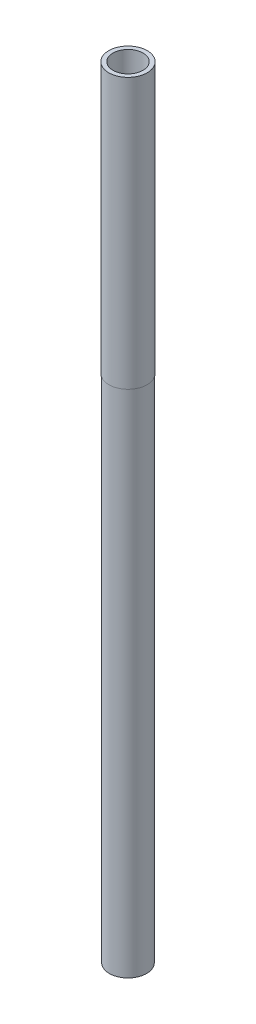
ISO-10303-21;
HEADER;
FILE_DESCRIPTION(('STEP AP214'),'2;1');
FILE_NAME('part.step','',(''),(''),'','','');
FILE_SCHEMA(('AUTOMOTIVE_DESIGN { 1 0 10303 214 1 1 1 1 }'));
ENDSEC;
DATA;
#1=APPLICATION_CONTEXT('core data for automotive mechanical design processes');
#2=APPLICATION_PROTOCOL_DEFINITION('international standard','automotive_design',2000,#1);
#3=PRODUCT_CONTEXT('',#1,'mechanical');
#4=PRODUCT('Part','Part','',(#3));
#5=PRODUCT_RELATED_PRODUCT_CATEGORY('part','',(#4));
#6=PRODUCT_DEFINITION_FORMATION('','',#4);
#7=PRODUCT_DEFINITION_CONTEXT('part definition',#1,'design');
#8=PRODUCT_DEFINITION('design','',#6,#7);
#9=PRODUCT_DEFINITION_SHAPE('','',#8);
#10=(LENGTH_UNIT() NAMED_UNIT(*) SI_UNIT(.MILLI.,.METRE.));
#11=(NAMED_UNIT(*) PLANE_ANGLE_UNIT() SI_UNIT($,.RADIAN.));
#12=(NAMED_UNIT(*) SI_UNIT($,.STERADIAN.) SOLID_ANGLE_UNIT());
#13=UNCERTAINTY_MEASURE_WITH_UNIT(LENGTH_MEASURE(1.E-05),#10,'distance_accuracy_value','');
#14=(GEOMETRIC_REPRESENTATION_CONTEXT(3) GLOBAL_UNCERTAINTY_ASSIGNED_CONTEXT((#13)) GLOBAL_UNIT_ASSIGNED_CONTEXT((#10,
#11,#12)) REPRESENTATION_CONTEXT('',''));
#15=CARTESIAN_POINT('',(0.,0.,0.));
#16=DIRECTION('',(0.,0.,1.));
#17=DIRECTION('',(1.,0.,0.));
#18=AXIS2_PLACEMENT_3D('',#15,#16,#17);
#19=CARTESIAN_POINT('',(0.,13.,0.));
#20=DIRECTION('',(0.,-1.,0.));
#21=DIRECTION('',(0.,0.,-1.));
#22=AXIS2_PLACEMENT_3D('',#19,#20,#21);
#23=CYLINDRICAL_SURFACE('',#22,0.310000000000001);
#24=CARTESIAN_POINT('',(0.,0.,0.));
#25=DIRECTION('',(0.,1.,0.));
#26=DIRECTION('',(0.,0.,1.));
#27=AXIS2_PLACEMENT_3D('',#24,#25,#26);
#28=CIRCLE('',#27,0.310000000000001);
#29=CARTESIAN_POINT('',(0.,0.,0.310000000000001));
#30=VERTEX_POINT('',#29);
#31=EDGE_CURVE('E36',#30,#30,#28,.T.);
#32=ORIENTED_EDGE('',*,*,#31,.T.);
#33=EDGE_LOOP('',(#32));
#34=FACE_BOUND('',#33,.T.);
#35=CARTESIAN_POINT('',(0.,8.5,0.));
#36=DIRECTION('',(0.,1.,0.));
#37=DIRECTION('',(0.,0.,1.));
#38=AXIS2_PLACEMENT_3D('',#35,#36,#37);
#39=CIRCLE('',#38,0.310000000000001);
#40=CARTESIAN_POINT('',(0.,8.5,0.310000000000001));
#41=VERTEX_POINT('',#40);
#42=EDGE_CURVE('E10',#41,#41,#39,.T.);
#43=ORIENTED_EDGE('',*,*,#42,.F.);
#44=EDGE_LOOP('',(#43));
#45=FACE_BOUND('',#44,.T.);
#46=ADVANCED_FACE('F30',(#34,#45),#23,.T.);
#47=CARTESIAN_POINT('',(0.,13.,0.));
#48=DIRECTION('',(0.,1.,0.));
#49=DIRECTION('',(0.,0.,1.));
#50=AXIS2_PLACEMENT_3D('',#47,#48,#49);
#51=PLANE('',#50);
#52=CARTESIAN_POINT('',(0.,13.,0.));
#53=DIRECTION('',(0.,1.,0.));
#54=DIRECTION('',(0.,0.,1.));
#55=AXIS2_PLACEMENT_3D('',#52,#53,#54);
#56=CIRCLE('',#55,0.25);
#57=CARTESIAN_POINT('',(0.,13.,0.25));
#58=VERTEX_POINT('',#57);
#59=EDGE_CURVE('E40',#58,#58,#56,.T.);
#60=ORIENTED_EDGE('',*,*,#59,.F.);
#61=EDGE_LOOP('',(#60));
#62=FACE_BOUND('',#61,.T.);
#63=CARTESIAN_POINT('',(0.,13.,0.));
#64=DIRECTION('',(0.,1.,0.));
#65=DIRECTION('',(0.,0.,1.));
#66=AXIS2_PLACEMENT_3D('',#63,#64,#65);
#67=CIRCLE('',#66,0.320000000000001);
#68=CARTESIAN_POINT('',(0.,13.,0.320000000000001));
#69=VERTEX_POINT('',#68);
#70=EDGE_CURVE('E50',#69,#69,#67,.T.);
#71=ORIENTED_EDGE('',*,*,#70,.T.);
#72=EDGE_LOOP('',(#71));
#73=FACE_BOUND('',#72,.T.);
#74=ADVANCED_FACE('F68',(#62,#73),#51,.T.);
#75=CARTESIAN_POINT('',(0.,0.,0.));
#76=DIRECTION('',(0.,1.,0.));
#77=DIRECTION('',(0.,0.,1.));
#78=AXIS2_PLACEMENT_3D('',#75,#76,#77);
#79=PLANE('',#78);
#80=ORIENTED_EDGE('',*,*,#31,.F.);
#81=EDGE_LOOP('',(#80));
#82=FACE_BOUND('',#81,.T.);
#83=CARTESIAN_POINT('',(0.,0.,0.));
#84=DIRECTION('',(0.,1.,0.));
#85=DIRECTION('',(0.,0.,1.));
#86=AXIS2_PLACEMENT_3D('',#83,#84,#85);
#87=CIRCLE('',#86,0.25);
#88=CARTESIAN_POINT('',(0.,0.,0.25));
#89=VERTEX_POINT('',#88);
#90=EDGE_CURVE('E44',#89,#89,#87,.T.);
#91=ORIENTED_EDGE('',*,*,#90,.T.);
#92=EDGE_LOOP('',(#91));
#93=FACE_BOUND('',#92,.T.);
#94=ADVANCED_FACE('F72',(#82,#93),#79,.F.);
#95=CARTESIAN_POINT('',(0.,13.,0.));
#96=DIRECTION('',(0.,-1.,0.));
#97=DIRECTION('',(0.,0.,-1.));
#98=AXIS2_PLACEMENT_3D('',#95,#96,#97);
#99=CYLINDRICAL_SURFACE('',#98,0.25);
#100=ORIENTED_EDGE('',*,*,#59,.T.);
#101=EDGE_LOOP('',(#100));
#102=FACE_BOUND('',#101,.T.);
#103=ORIENTED_EDGE('',*,*,#90,.F.);
#104=EDGE_LOOP('',(#103));
#105=FACE_BOUND('',#104,.T.);
#106=ADVANCED_FACE('F65',(#102,#105),#99,.F.);
#107=CARTESIAN_POINT('',(0.,8.5,0.));
#108=DIRECTION('',(0.,1.,0.));
#109=DIRECTION('',(0.,0.,1.));
#110=AXIS2_PLACEMENT_3D('',#107,#108,#109);
#111=CYLINDRICAL_SURFACE('',#110,0.320000000000001);
#112=CARTESIAN_POINT('',(0.,8.5,0.));
#113=DIRECTION('',(0.,1.,0.));
#114=DIRECTION('',(0.,0.,1.));
#115=AXIS2_PLACEMENT_3D('',#112,#113,#114);
#116=CIRCLE('',#115,0.320000000000001);
#117=CARTESIAN_POINT('',(0.,8.5,0.320000000000001));
#118=VERTEX_POINT('',#117);
#119=EDGE_CURVE('E48',#118,#118,#116,.T.);
#120=ORIENTED_EDGE('',*,*,#119,.T.);
#121=EDGE_LOOP('',(#120));
#122=FACE_BOUND('',#121,.T.);
#123=ORIENTED_EDGE('',*,*,#70,.F.);
#124=EDGE_LOOP('',(#123));
#125=FACE_BOUND('',#124,.T.);
#126=ADVANCED_FACE('F56',(#122,#125),#111,.T.);
#127=CARTESIAN_POINT('',(0.,8.5,0.));
#128=DIRECTION('',(0.,1.,0.));
#129=DIRECTION('',(0.,0.,1.));
#130=AXIS2_PLACEMENT_3D('',#127,#128,#129);
#131=PLANE('',#130);
#132=ORIENTED_EDGE('',*,*,#42,.T.);
#133=EDGE_LOOP('',(#132));
#134=FACE_BOUND('',#133,.T.);
#135=ORIENTED_EDGE('',*,*,#119,.F.);
#136=EDGE_LOOP('',(#135));
#137=FACE_BOUND('',#136,.T.);
#138=ADVANCED_FACE('F59',(#134,#137),#131,.F.);
#139=CLOSED_SHELL('',(#46,#74,#94,#106,#126,#138));
#140=MANIFOLD_SOLID_BREP('B2',#139);
#141=ADVANCED_BREP_SHAPE_REPRESENTATION('',(#18,#140),#14);
#142=SHAPE_DEFINITION_REPRESENTATION(#9,#141);
ENDSEC;
END-ISO-10303-21;
